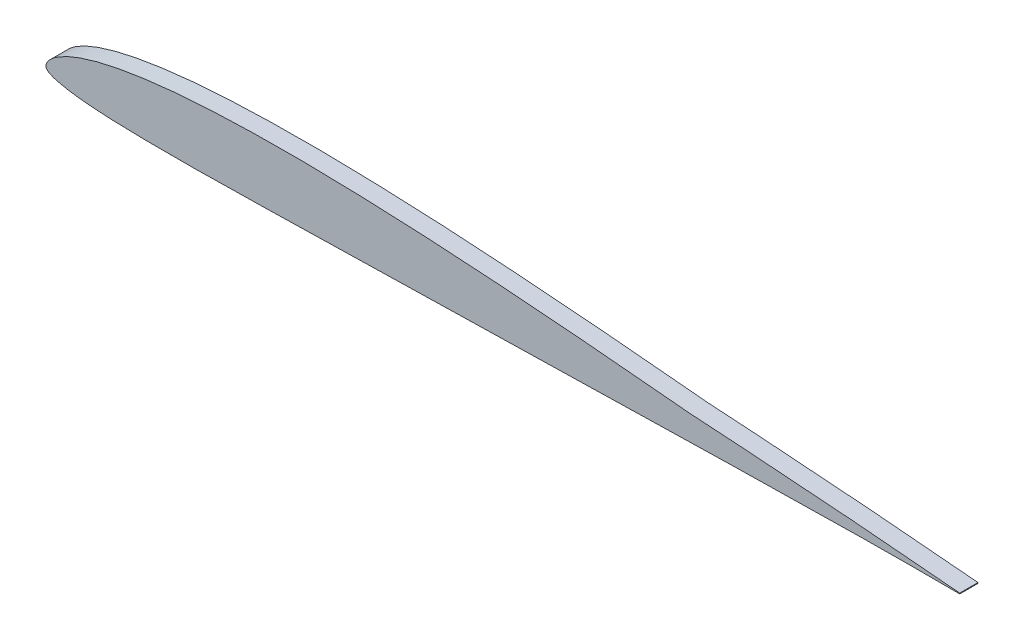
ISO-10303-21;
HEADER;
FILE_DESCRIPTION(('STEP AP214'),'2;1');
FILE_NAME('part.step','',(''),(''),'','','');
FILE_SCHEMA(('AUTOMOTIVE_DESIGN { 1 0 10303 214 1 1 1 1 }'));
ENDSEC;
DATA;
#1=APPLICATION_CONTEXT('core data for automotive mechanical design processes');
#2=APPLICATION_PROTOCOL_DEFINITION('international standard','automotive_design',2000,#1);
#3=PRODUCT_CONTEXT('',#1,'mechanical');
#4=PRODUCT('Part','Part','',(#3));
#5=PRODUCT_RELATED_PRODUCT_CATEGORY('part','',(#4));
#6=PRODUCT_DEFINITION_FORMATION('','',#4);
#7=PRODUCT_DEFINITION_CONTEXT('part definition',#1,'design');
#8=PRODUCT_DEFINITION('design','',#6,#7);
#9=PRODUCT_DEFINITION_SHAPE('','',#8);
#10=(LENGTH_UNIT() NAMED_UNIT(*) SI_UNIT(.MILLI.,.METRE.));
#11=(NAMED_UNIT(*) PLANE_ANGLE_UNIT() SI_UNIT($,.RADIAN.));
#12=(NAMED_UNIT(*) SI_UNIT($,.STERADIAN.) SOLID_ANGLE_UNIT());
#13=UNCERTAINTY_MEASURE_WITH_UNIT(LENGTH_MEASURE(1.E-05),#10,'distance_accuracy_value','');
#14=(GEOMETRIC_REPRESENTATION_CONTEXT(3) GLOBAL_UNCERTAINTY_ASSIGNED_CONTEXT((#13)) GLOBAL_UNIT_ASSIGNED_CONTEXT((#10,
#11,#12)) REPRESENTATION_CONTEXT('',''));
#15=CARTESIAN_POINT('',(0.,0.,0.));
#16=DIRECTION('',(0.,0.,1.));
#17=DIRECTION('',(1.,0.,0.));
#18=AXIS2_PLACEMENT_3D('',#15,#16,#17);
#19=CARTESIAN_POINT('',(127.,0.,1.27));
#20=DIRECTION('',(1.,0.,0.));
#21=DIRECTION('',(0.,0.,-1.));
#22=AXIS2_PLACEMENT_3D('',#19,#20,#21);
#23=PLANE('',#22);
#24=DIRECTION('',(0.,-1.,0.));
#25=VECTOR('',#24,1.);
#26=CARTESIAN_POINT('',(127.,0.,-1.27));
#27=LINE('',#26,#25);
#28=CARTESIAN_POINT('',(127.,0.053594,-1.27));
#29=VERTEX_POINT('',#28);
#30=CARTESIAN_POINT('',(127.,-0.053594,-1.27));
#31=VERTEX_POINT('',#30);
#32=EDGE_CURVE('E71',#29,#31,#27,.T.);
#33=ORIENTED_EDGE('',*,*,#32,.F.);
#34=DIRECTION('',(0.,0.,-1.));
#35=VECTOR('',#34,1.);
#36=CARTESIAN_POINT('',(127.,0.053594,1.27));
#37=LINE('',#36,#35);
#38=CARTESIAN_POINT('',(127.,0.053594,1.27));
#39=VERTEX_POINT('',#38);
#40=EDGE_CURVE('E11',#39,#29,#37,.T.);
#41=ORIENTED_EDGE('',*,*,#40,.F.);
#42=DIRECTION('',(0.,-1.,0.));
#43=VECTOR('',#42,1.);
#44=CARTESIAN_POINT('',(127.,0.,1.27));
#45=LINE('',#44,#43);
#46=CARTESIAN_POINT('',(127.,-0.053594,1.27));
#47=VERTEX_POINT('',#46);
#48=EDGE_CURVE('E72',#39,#47,#45,.T.);
#49=ORIENTED_EDGE('',*,*,#48,.T.);
#50=DIRECTION('',(0.,0.,-1.));
#51=VECTOR('',#50,1.);
#52=CARTESIAN_POINT('',(127.,-0.053594,1.27));
#53=LINE('',#52,#51);
#54=EDGE_CURVE('E51',#47,#31,#53,.T.);
#55=ORIENTED_EDGE('',*,*,#54,.T.);
#56=EDGE_LOOP('',(#33,#41,#49,#55));
#57=FACE_BOUND('',#56,.T.);
#58=ADVANCED_FACE('F43',(#57),#23,.T.);
#59=CARTESIAN_POINT('',(127.,0.053594,1.27));
#60=CARTESIAN_POINT('',(126.75319418678,0.0760877001744708,1.27));
#61=CARTESIAN_POINT('',(126.004566690037,0.144317059258043,1.27));
#62=CARTESIAN_POINT('',(124.687918153398,0.26566799016535,1.27));
#63=CARTESIAN_POINT('',(123.038030908359,0.409881648552028,1.27));
#64=CARTESIAN_POINT('',(121.307814074259,0.562155781187174,1.27));
#65=CARTESIAN_POINT('',(119.562633129905,0.71539766714406,1.27));
#66=CARTESIAN_POINT('',(117.812451704404,0.862564501981652,1.27));
#67=CARTESIAN_POINT('',(116.060214862568,1.00963672396759,1.27));
#68=CARTESIAN_POINT('',(114.306556411543,1.15328943024605,1.27));
#69=CARTESIAN_POINT('',(112.552387700521,1.29540650039443,1.27));
#70=CARTESIAN_POINT('',(110.798143323315,1.43442600335188,1.27));
#71=CARTESIAN_POINT('',(109.044365051303,1.5697547189875,1.27));
#72=CARTESIAN_POINT('',(107.291127286056,1.70453720468118,1.27));
#73=CARTESIAN_POINT('',(105.538591662357,1.83509140961561,1.27));
#74=CARTESIAN_POINT('',(103.78639240883,1.96419243775851,1.27));
#75=CARTESIAN_POINT('',(102.035125628558,2.09083844017822,1.27));
#76=CARTESIAN_POINT('',(100.284111126628,2.21396621736763,1.27));
#77=CARTESIAN_POINT('',(98.5338976732414,2.33644210727316,1.27));
#78=CARTESIAN_POINT('',(96.7839424193181,2.45553164938213,1.27));
#79=CARTESIAN_POINT('',(95.0346733309256,2.57230288775048,1.27));
#80=CARTESIAN_POINT('',(93.2855928271933,2.68714132598535,1.27));
#81=CARTESIAN_POINT('',(91.6673332137048,2.79159765227263,1.27));
#82=CARTESIAN_POINT('',(90.4092468709104,2.86960854047511,1.27));
#83=CARTESIAN_POINT('',(89.6232392785291,2.92147422543708,1.27));
#84=CARTESIAN_POINT('',(89.1782217924196,2.94414302640635,1.27));
#85=CARTESIAN_POINT('',(88.7362174579676,2.99151949227848,1.27));
#86=CARTESIAN_POINT('',(87.806500922895,3.07780939720151,1.27));
#87=CARTESIAN_POINT('',(86.3898248414768,3.21548481973008,1.27));
#88=CARTESIAN_POINT('',(84.9000745153053,3.35447567014728,1.27));
#89=CARTESIAN_POINT('',(83.5684462066837,3.47796115845127,1.27));
#90=CARTESIAN_POINT('',(82.3752833123043,3.58792063544386,1.27));
#91=CARTESIAN_POINT('',(80.8801635342438,3.72362614706067,1.27));
#92=CARTESIAN_POINT('',(79.1335610085478,3.88022628497266,1.27));
#93=CARTESIAN_POINT('',(77.3507061312034,4.03664925236581,1.27));
#94=CARTESIAN_POINT('',(75.5725163597116,4.18976836858316,1.27));
#95=CARTESIAN_POINT('',(73.8962587069289,4.33145377178328,1.27));
#96=CARTESIAN_POINT('',(72.2473727584334,4.46819039633799,1.27));
#97=CARTESIAN_POINT('',(70.8107414794783,4.58452840088692,1.27));
#98=CARTESIAN_POINT('',(69.6250397239119,4.67886406842905,1.27));
#99=CARTESIAN_POINT('',(68.3207797811173,4.78153377662967,1.27));
#100=CARTESIAN_POINT('',(66.8095914194517,4.89708183853389,1.27));
#101=CARTESIAN_POINT('',(65.0516605711408,5.02794392826452,1.27));
#102=CARTESIAN_POINT('',(63.2948900599047,5.15483673146866,1.27));
#103=CARTESIAN_POINT('',(60.9536399747879,5.31758786620498,1.27));
#104=CARTESIAN_POINT('',(58.6126490489154,5.47098533673743,1.27));
#105=CARTESIAN_POINT('',(56.2721308783602,5.61420587073317,1.27));
#106=CARTESIAN_POINT('',(54.5171554717241,5.71592524235253,1.27));
#107=CARTESIAN_POINT('',(52.1778177503657,5.84388822955764,1.27));
#108=CARTESIAN_POINT('',(49.8387184498259,5.95955970656226,1.27));
#109=CARTESIAN_POINT('',(47.49975183569,6.06166642703131,1.27));
#110=CARTESIAN_POINT('',(45.7461424988307,6.13153393158493,1.27));
#111=CARTESIAN_POINT('',(43.9929299603124,6.19316573020814,1.27));
#112=CARTESIAN_POINT('',(42.2402337876286,6.2469961682925,1.27));
#113=CARTESIAN_POINT('',(40.4882960744335,6.29239290652403,1.27));
#114=CARTESIAN_POINT('',(38.737205547812,6.32905629803844,1.27));
#115=CARTESIAN_POINT('',(36.9869912717093,6.3556705862806,1.27));
#116=CARTESIAN_POINT('',(35.2376678321487,6.37260324040424,1.27));
#117=CARTESIAN_POINT('',(33.4893907882479,6.37811191747323,1.27));
#118=CARTESIAN_POINT('',(31.742631161427,6.37192436236067,1.27));
#119=CARTESIAN_POINT('',(29.9975985158761,6.3531061745645,1.27));
#120=CARTESIAN_POINT('',(28.2547053622742,6.32103419240919,1.27));
#121=CARTESIAN_POINT('',(26.5142128192393,6.27395958198846,1.27));
#122=CARTESIAN_POINT('',(24.7767898217828,6.21093638304498,1.27));
#123=CARTESIAN_POINT('',(23.0433085854579,6.13069727113427,1.27));
#124=CARTESIAN_POINT('',(21.3143419035432,6.03117546444319,1.27));
#125=CARTESIAN_POINT('',(19.5913019235269,5.91138431241881,1.27));
#126=CARTESIAN_POINT('',(17.8753495630138,5.76821711898868,1.27));
#127=CARTESIAN_POINT('',(16.1680579760262,5.60017011071629,1.27));
#128=CARTESIAN_POINT('',(14.4722222518829,5.4033611781826,1.27));
#129=CARTESIAN_POINT('',(12.7903106392628,5.17550056025144,1.27));
#130=CARTESIAN_POINT('',(11.1272444513852,4.91189318520712,1.27));
#131=CARTESIAN_POINT('',(9.48772354162016,4.60720365358825,1.27));
#132=CARTESIAN_POINT('',(7.88100221551244,4.25542493792263,1.27));
#133=CARTESIAN_POINT('',(6.3216712421272,3.84919262199121,1.27));
#134=CARTESIAN_POINT('',(4.83837715763251,3.38537580015949,1.27));
#135=CARTESIAN_POINT('',(3.486169199981,2.86843121232047,1.27));
#136=CARTESIAN_POINT('',(2.34428983938669,2.32629002564457,1.27));
#137=CARTESIAN_POINT('',(1.47383404058277,1.80503420464493,1.27));
#138=CARTESIAN_POINT('',(0.873330800915139,1.34824020045603,1.27));
#139=CARTESIAN_POINT('',(0.483486894676334,0.969607531010342,1.27));
#140=CARTESIAN_POINT('',(0.235533738492551,0.655623709812797,1.27));
#141=CARTESIAN_POINT('',(0.0853520342493378,0.388606742708587,1.27));
#142=CARTESIAN_POINT('',(0.00927812601699419,0.159258482741594,1.27));
#143=CARTESIAN_POINT('',(-0.00821266072434666,-0.0427394405466579,1.27));
#144=CARTESIAN_POINT('',(0.0354334525350738,-0.233172338273624,1.27));
#145=CARTESIAN_POINT('',(0.160769968704994,-0.416078938521712,1.27));
#146=CARTESIAN_POINT('',(0.381844650874673,-0.578881525146638,1.27));
#147=CARTESIAN_POINT('',(0.702443674424843,-0.744483607979924,1.27));
#148=CARTESIAN_POINT('',(1.17377330793498,-0.923146695812726,1.27));
#149=CARTESIAN_POINT('',(1.87333696743001,-1.12192190327629,1.27));
#150=CARTESIAN_POINT('',(2.8633520711794,-1.32505144247377,1.27));
#151=CARTESIAN_POINT('',(4.13416468959408,-1.51440155121324,1.27));
#152=CARTESIAN_POINT('',(5.60877230207486,-1.67130723470471,1.27));
#153=CARTESIAN_POINT('',(7.1968927420956,-1.79206351657872,1.27));
#154=CARTESIAN_POINT('',(8.84203352220401,-1.88152604872054,1.27));
#155=CARTESIAN_POINT('',(10.5181010575966,-1.94501168978351,1.27));
#156=CARTESIAN_POINT('',(12.2137609505441,-1.98813481324923,1.27));
#157=CARTESIAN_POINT('',(13.923057968309,-2.01560335210805,1.27));
#158=CARTESIAN_POINT('',(15.6423059881636,-2.03055921304403,1.27));
#159=CARTESIAN_POINT('',(17.3693244917074,-2.03524324043674,1.27));
#160=CARTESIAN_POINT('',(19.1022592805304,-2.03037626821547,1.27));
#161=CARTESIAN_POINT('',(20.8401786618786,-2.01766100085378,1.27));
#162=CARTESIAN_POINT('',(22.581905240807,-1.99865422441457,1.27));
#163=CARTESIAN_POINT('',(24.327094148843,-1.97387003457827,1.27));
#164=CARTESIAN_POINT('',(26.0753733328439,-1.94491886359659,1.27));
#165=CARTESIAN_POINT('',(27.8272480845776,-1.91247873352249,1.27));
#166=CARTESIAN_POINT('',(29.5827269991568,-1.87760557598646,1.27));
#167=CARTESIAN_POINT('',(31.3420004639669,-1.84001927232577,1.27));
#168=CARTESIAN_POINT('',(33.1050651717955,-1.80190503114857,1.27));
#169=CARTESIAN_POINT('',(34.8722611776463,-1.76181877106513,1.27));
#170=CARTESIAN_POINT('',(36.6433146413193,-1.72100873165829,1.27));
#171=CARTESIAN_POINT('',(39.0108549371328,-1.66598694245539,1.27));
#172=CARTESIAN_POINT('',(41.381807412762,-1.60982731922993,1.27));
#173=CARTESIAN_POINT('',(43.7556056099178,-1.55381431875926,1.27));
#174=CARTESIAN_POINT('',(45.5385613105355,-1.5118494587281,1.27));
#175=CARTESIAN_POINT('',(47.3230333012694,-1.4695577504753,1.27));
#176=CARTESIAN_POINT('',(49.109250939379,-1.42764702237356,1.27));
#177=CARTESIAN_POINT('',(50.8974469594195,-1.38534156633297,1.27));
#178=CARTESIAN_POINT('',(52.686668924325,-1.34354342337719,1.27));
#179=CARTESIAN_POINT('',(54.475758497215,-1.3017274896245,1.27));
#180=CARTESIAN_POINT('',(56.2636196049197,-1.26012891208434,1.27));
#181=CARTESIAN_POINT('',(58.0503489114842,-1.21918597496924,1.27));
#182=CARTESIAN_POINT('',(59.8359986993292,-1.17761891256773,1.27));
#183=CARTESIAN_POINT('',(61.6204835927979,-1.13719504943686,1.27));
#184=CARTESIAN_POINT('',(63.4036441961708,-1.0966712943528,1.27));
#185=CARTESIAN_POINT('',(65.1856299674993,-1.05682485339863,1.27));
#186=CARTESIAN_POINT('',(66.9668411292636,-1.01667131145609,1.27));
#187=CARTESIAN_POINT('',(68.4747155725429,-0.983169691587939,1.27));
#188=CARTESIAN_POINT('',(70.2327829516203,-0.944255706780592,1.27));
#189=CARTESIAN_POINT('',(71.9672116383846,-0.905142512978061,1.27));
#190=CARTESIAN_POINT('',(73.9389771714879,-0.861463719592707,1.27));
#191=CARTESIAN_POINT('',(75.6551313622511,-0.823379674525717,1.27));
#192=CARTESIAN_POINT('',(77.3771162941416,-0.784663907131596,1.27));
#193=CARTESIAN_POINT('',(79.1169773862875,-0.746124442235304,1.27));
#194=CARTESIAN_POINT('',(80.6742928648956,-0.711626582348122,1.27));
#195=CARTESIAN_POINT('',(82.0377216584819,-0.681571553462625,1.27));
#196=CARTESIAN_POINT('',(83.189530455548,-0.656499214931409,1.27));
#197=CARTESIAN_POINT('',(84.5144318257775,-0.627441819123932,1.27));
#198=CARTESIAN_POINT('',(86.0361490285046,-0.59465529362139,1.27));
#199=CARTESIAN_POINT('',(87.4422888360555,-0.564185093919824,1.27));
#200=CARTESIAN_POINT('',(88.3954729035382,-0.544103577834738,1.27));
#201=CARTESIAN_POINT('',(88.8577451923321,-0.534031479617068,1.27));
#202=CARTESIAN_POINT('',(89.2505708617652,-0.526534285850712,1.27));
#203=CARTESIAN_POINT('',(90.0479873182019,-0.50896665570495,1.27));
#204=CARTESIAN_POINT('',(91.3450853055115,-0.481934603285221,1.27));
#205=CARTESIAN_POINT('',(93.0499315672945,-0.446327811565067,1.27));
#206=CARTESIAN_POINT('',(94.810657831413,-0.410085949918938,1.27));
#207=CARTESIAN_POINT('',(96.5704598214829,-0.374659880593233,1.27));
#208=CARTESIAN_POINT('',(98.3297848514143,-0.339179196717107,1.27));
#209=CARTESIAN_POINT('',(100.089333738135,-0.304693934884913,1.27));
#210=CARTESIAN_POINT('',(101.849164272931,-0.270047734707037,1.27));
#211=CARTESIAN_POINT('',(103.609427245489,-0.236629082761936,1.27));
#212=CARTESIAN_POINT('',(105.369927979664,-0.203795697934821,1.27));
#213=CARTESIAN_POINT('',(107.130919286059,-0.174231328217744,1.27));
#214=CARTESIAN_POINT('',(109.479457842885,-0.136894235956948,1.27));
#215=CARTESIAN_POINT('',(111.828794682434,-0.105060521529225,1.27));
#216=CARTESIAN_POINT('',(114.178357375734,-0.0783243595165123,1.27));
#217=CARTESIAN_POINT('',(115.941250847604,-0.0622964832726548,1.27));
#218=CARTESIAN_POINT('',(117.704221306388,-0.0489030142464174,1.27));
#219=CARTESIAN_POINT('',(119.467622016746,-0.0400310488749213,1.27));
#220=CARTESIAN_POINT('',(121.230174814352,-0.0355740861482252,1.27));
#221=CARTESIAN_POINT('',(122.981472145956,-0.0348565956638897,1.27));
#222=CARTESIAN_POINT('',(124.653848232825,-0.0417553928143516,1.27));
#223=CARTESIAN_POINT('',(125.989887142712,-0.0478343990504751,1.27));
#224=CARTESIAN_POINT('',(126.749429153548,-0.05216526055298,1.27));
#225=CARTESIAN_POINT('',(127.,-0.053594,1.27));
#226=B_SPLINE_CURVE_WITH_KNOTS('',3,(#59,#60,#61,#62,#63,#64,#65,#66,#67,#68,#69,#70,#71,#72,
#73,#74,#75,#76,#77,#78,#79,#80,#81,#82,#83,#84,#85,#86,#87,#88,#89,#90,#91,#92,#93,#94,#95,#96,
#97,#98,#99,#100,#101,#102,#103,#104,#105,#106,#107,#108,#109,#110,#111,#112,#113,#114,#115,
#116,#117,#118,#119,#120,#121,#122,#123,#124,#125,#126,#127,#128,#129,#130,#131,#132,#133,#134,
#135,#136,#137,#138,#139,#140,#141,#142,#143,#144,#145,#146,#147,#148,#149,#150,#151,#152,#153,
#154,#155,#156,#157,#158,#159,#160,#161,#162,#163,#164,#165,#166,#167,#168,#169,#170,#171,#172,
#173,#174,#175,#176,#177,#178,#179,#180,#181,#182,#183,#184,#185,#186,#187,#188,#189,#190,#191,
#192,#193,#194,#195,#196,#197,#198,#199,#200,#201,#202,#203,#204,#205,#206,#207,#208,#209,#210,
#211,#212,#213,#214,#215,#216,#217,#218,#219,#220,#221,#222,#223,#224,#225),.UNSPECIFIED.,.F.,
.F.,(4,1,1,1,1,1,1,1,1,1,1,1,1,1,1,1,1,1,1,1,1,1,1,1,1,1,1,1,1,1,1,1,1,1,1,1,1,1,1,1,1,1,1,1,1,
1,1,1,1,1,1,1,1,1,1,1,1,1,1,1,1,1,1,1,1,1,1,1,1,1,1,1,1,1,1,1,1,1,1,1,1,1,1,1,1,1,1,1,1,1,1,1,1,
1,1,1,1,1,1,1,1,1,1,1,1,1,1,1,1,1,1,1,1,1,1,1,1,1,1,1,1,1,1,1,1,1,1,1,1,1,1,1,1,1,1,1,1,1,1,1,1,
1,1,1,1,1,1,1,1,1,1,1,1,1,1,1,1,1,1,1,1,1,1,1,4),(0.,0.00290099659372873,0.00879949215818137,
0.0154775211449576,0.0222875942353728,0.0291311059359383,0.0359845727886083,0.0428468815231683,
0.0497142979882809,0.0565810302604014,0.0634478411876994,0.0703132293701872,0.0771711678945666,
0.0840311741497836,0.090884627100437,0.0977373955031283,0.10458440936198,0.111431995724545,
0.118274877415409,0.125116136448488,0.131953904848395,0.13879304095194,0.144098462846876,
0.146708547028149,0.148014315644422,0.149313146551483,0.151910855866899,0.15894466195637,
0.165973894108373,0.169425197998219,0.174599098038009,0.179999827222256,0.186998483896338,
0.195126221538068,0.200949456634637,0.207890370980172,0.214817865515354,0.22031697801188,
0.224762113608554,0.228741131521326,0.235631413074054,0.24250316876118,0.24937577864735,
0.256249105242001,0.269975124298455,0.276837253986749,0.283697593009064,0.290552692507618,
0.30426160656467,0.311111522811174,0.317957828523149,0.324804965375357,0.331646617506474,
0.338483878107494,0.345319338276512,0.352148660719282,0.358973534693761,0.365797142126222,
0.372613328234074,0.37942045451472,0.386224884987997,0.393018255101135,0.399801225843235,
0.406575620561957,0.41333111749985,0.420072961630209,0.426793048043559,0.433486562415399,
0.440153627327362,0.4467760361761,0.453352888479925,0.459861970007757,0.466293611508859,
0.472602109032427,0.478718386362554,0.484476600917274,0.489534096861973,0.493495638696748,
0.496331130758294,0.498346313282037,0.499841011263958,0.500999223663144,0.501914653491868,
0.502649229242367,0.503345398266634,0.50415780520335,0.505185160296857,0.506525739891464,
0.508375842410537,0.511073874727062,0.515031356802908,0.520196696865689,0.526108614995491,
0.532386125291835,0.538838474427164,0.545393384701584,0.552018992727712,0.558693317056157,
0.565404176163481,0.572144526051526,0.578909154577512,0.585689295212745,0.592488493333882,
0.59929836847987,0.606119896932364,0.612956027325966,0.619808706789196,0.62667296427988,
0.633554161890214,0.640451344600834,0.647364459483236,0.654290996191379,0.668172423609916,
0.675125781726664,0.682085580061521,0.689048857897814,0.696020050472818,0.703000171948541,
0.709986710377743,0.716969769396795,0.723948346696876,0.73092044933395,0.737890086365544,
0.744856198708493,0.751814361966286,0.758768528400392,0.765720713177421,0.772669892235555,
0.776423533560404,0.786305074021238,0.792977667356492,0.799509991668968,0.806398718942054,
0.813139712830137,0.819881191153094,0.824632580087798,0.829103409178679,0.833367054905999,
0.840145140127739,0.846920231426965,0.849830696568046,0.851305256070526,0.85233270963581,
0.854429810086703,0.860641790464031,0.867519382964738,0.874390493827504,0.881256599829939,
0.888123181315473,0.894988722653487,0.901857217200624,0.908727131150569,0.915597457074931,
0.922468598797302,0.929343574538009,0.943092095045522,0.949971603935152,0.956848493312481,
0.963728748261155,0.970608901330828,0.977490476697614,0.984360631540857,0.991108923943024,
0.997066858157041,1.),.UNSPECIFIED.);
#227=DIRECTION('',(0.,0.,-1.));
#228=VECTOR('',#227,1.);
#229=SURFACE_OF_LINEAR_EXTRUSION('',#226,#228);
#230=CARTESIAN_POINT('',(127.,0.053594,-1.27));
#231=CARTESIAN_POINT('',(126.75319418678,0.0760877001744708,-1.27));
#232=CARTESIAN_POINT('',(126.004566690037,0.144317059258043,-1.27));
#233=CARTESIAN_POINT('',(124.687918153398,0.26566799016535,-1.27));
#234=CARTESIAN_POINT('',(123.038030908359,0.409881648552028,-1.27));
#235=CARTESIAN_POINT('',(121.307814074259,0.562155781187174,-1.27));
#236=CARTESIAN_POINT('',(119.562633129905,0.71539766714406,-1.27));
#237=CARTESIAN_POINT('',(117.812451704404,0.862564501981652,-1.27));
#238=CARTESIAN_POINT('',(116.060214862568,1.00963672396759,-1.27));
#239=CARTESIAN_POINT('',(114.306556411543,1.15328943024605,-1.27));
#240=CARTESIAN_POINT('',(112.552387700521,1.29540650039443,-1.27));
#241=CARTESIAN_POINT('',(110.798143323315,1.43442600335188,-1.27));
#242=CARTESIAN_POINT('',(109.044365051303,1.5697547189875,-1.27));
#243=CARTESIAN_POINT('',(107.291127286056,1.70453720468118,-1.27));
#244=CARTESIAN_POINT('',(105.538591662357,1.83509140961561,-1.27));
#245=CARTESIAN_POINT('',(103.78639240883,1.96419243775851,-1.27));
#246=CARTESIAN_POINT('',(102.035125628558,2.09083844017822,-1.27));
#247=CARTESIAN_POINT('',(100.284111126628,2.21396621736763,-1.27));
#248=CARTESIAN_POINT('',(98.5338976732414,2.33644210727316,-1.27));
#249=CARTESIAN_POINT('',(96.7839424193181,2.45553164938213,-1.27));
#250=CARTESIAN_POINT('',(95.0346733309256,2.57230288775048,-1.27));
#251=CARTESIAN_POINT('',(93.2855928271933,2.68714132598535,-1.27));
#252=CARTESIAN_POINT('',(91.6673332137048,2.79159765227263,-1.27));
#253=CARTESIAN_POINT('',(90.4092468709104,2.86960854047511,-1.27));
#254=CARTESIAN_POINT('',(89.6232392785291,2.92147422543708,-1.27));
#255=CARTESIAN_POINT('',(89.1782217924196,2.94414302640635,-1.27));
#256=CARTESIAN_POINT('',(88.7362174579676,2.99151949227848,-1.27));
#257=CARTESIAN_POINT('',(87.806500922895,3.07780939720151,-1.27));
#258=CARTESIAN_POINT('',(86.3898248414768,3.21548481973008,-1.27));
#259=CARTESIAN_POINT('',(84.9000745153053,3.35447567014728,-1.27));
#260=CARTESIAN_POINT('',(83.5684462066837,3.47796115845127,-1.27));
#261=CARTESIAN_POINT('',(82.3752833123043,3.58792063544386,-1.27));
#262=CARTESIAN_POINT('',(80.8801635342438,3.72362614706067,-1.27));
#263=CARTESIAN_POINT('',(79.1335610085478,3.88022628497266,-1.27));
#264=CARTESIAN_POINT('',(77.3507061312034,4.03664925236581,-1.27));
#265=CARTESIAN_POINT('',(75.5725163597116,4.18976836858316,-1.27));
#266=CARTESIAN_POINT('',(73.8962587069289,4.33145377178328,-1.27));
#267=CARTESIAN_POINT('',(72.2473727584334,4.46819039633799,-1.27));
#268=CARTESIAN_POINT('',(70.8107414794783,4.58452840088692,-1.27));
#269=CARTESIAN_POINT('',(69.6250397239119,4.67886406842905,-1.27));
#270=CARTESIAN_POINT('',(68.3207797811173,4.78153377662967,-1.27));
#271=CARTESIAN_POINT('',(66.8095914194517,4.89708183853389,-1.27));
#272=CARTESIAN_POINT('',(65.0516605711408,5.02794392826452,-1.27));
#273=CARTESIAN_POINT('',(63.2948900599047,5.15483673146866,-1.27));
#274=CARTESIAN_POINT('',(60.9536399747879,5.31758786620498,-1.27));
#275=CARTESIAN_POINT('',(58.6126490489154,5.47098533673743,-1.27));
#276=CARTESIAN_POINT('',(56.2721308783602,5.61420587073317,-1.27));
#277=CARTESIAN_POINT('',(54.5171554717241,5.71592524235253,-1.27));
#278=CARTESIAN_POINT('',(52.1778177503657,5.84388822955764,-1.27));
#279=CARTESIAN_POINT('',(49.8387184498259,5.95955970656226,-1.27));
#280=CARTESIAN_POINT('',(47.49975183569,6.06166642703131,-1.27));
#281=CARTESIAN_POINT('',(45.7461424988307,6.13153393158493,-1.27));
#282=CARTESIAN_POINT('',(43.9929299603124,6.19316573020814,-1.27));
#283=CARTESIAN_POINT('',(42.2402337876286,6.2469961682925,-1.27));
#284=CARTESIAN_POINT('',(40.4882960744335,6.29239290652403,-1.27));
#285=CARTESIAN_POINT('',(38.737205547812,6.32905629803844,-1.27));
#286=CARTESIAN_POINT('',(36.9869912717093,6.3556705862806,-1.27));
#287=CARTESIAN_POINT('',(35.2376678321487,6.37260324040424,-1.27));
#288=CARTESIAN_POINT('',(33.4893907882479,6.37811191747323,-1.27));
#289=CARTESIAN_POINT('',(31.742631161427,6.37192436236067,-1.27));
#290=CARTESIAN_POINT('',(29.9975985158761,6.3531061745645,-1.27));
#291=CARTESIAN_POINT('',(28.2547053622742,6.32103419240919,-1.27));
#292=CARTESIAN_POINT('',(26.5142128192393,6.27395958198846,-1.27));
#293=CARTESIAN_POINT('',(24.7767898217828,6.21093638304498,-1.27));
#294=CARTESIAN_POINT('',(23.0433085854579,6.13069727113427,-1.27));
#295=CARTESIAN_POINT('',(21.3143419035432,6.03117546444319,-1.27));
#296=CARTESIAN_POINT('',(19.5913019235269,5.91138431241881,-1.27));
#297=CARTESIAN_POINT('',(17.8753495630138,5.76821711898868,-1.27));
#298=CARTESIAN_POINT('',(16.1680579760262,5.60017011071629,-1.27));
#299=CARTESIAN_POINT('',(14.4722222518829,5.4033611781826,-1.27));
#300=CARTESIAN_POINT('',(12.7903106392628,5.17550056025144,-1.27));
#301=CARTESIAN_POINT('',(11.1272444513852,4.91189318520712,-1.27));
#302=CARTESIAN_POINT('',(9.48772354162016,4.60720365358825,-1.27));
#303=CARTESIAN_POINT('',(7.88100221551244,4.25542493792263,-1.27));
#304=CARTESIAN_POINT('',(6.3216712421272,3.84919262199121,-1.27));
#305=CARTESIAN_POINT('',(4.83837715763251,3.38537580015949,-1.27));
#306=CARTESIAN_POINT('',(3.486169199981,2.86843121232047,-1.27));
#307=CARTESIAN_POINT('',(2.34428983938669,2.32629002564457,-1.27));
#308=CARTESIAN_POINT('',(1.47383404058277,1.80503420464493,-1.27));
#309=CARTESIAN_POINT('',(0.873330800915139,1.34824020045603,-1.27));
#310=CARTESIAN_POINT('',(0.483486894676334,0.969607531010342,-1.27));
#311=CARTESIAN_POINT('',(0.235533738492551,0.655623709812797,-1.27));
#312=CARTESIAN_POINT('',(0.0853520342493378,0.388606742708587,-1.27));
#313=CARTESIAN_POINT('',(0.00927812601699419,0.159258482741594,-1.27));
#314=CARTESIAN_POINT('',(-0.00821266072434666,-0.0427394405466579,-1.27));
#315=CARTESIAN_POINT('',(0.0354334525350738,-0.233172338273624,-1.27));
#316=CARTESIAN_POINT('',(0.160769968704994,-0.416078938521712,-1.27));
#317=CARTESIAN_POINT('',(0.381844650874673,-0.578881525146638,-1.27));
#318=CARTESIAN_POINT('',(0.702443674424843,-0.744483607979924,-1.27));
#319=CARTESIAN_POINT('',(1.17377330793498,-0.923146695812726,-1.27));
#320=CARTESIAN_POINT('',(1.87333696743001,-1.12192190327629,-1.27));
#321=CARTESIAN_POINT('',(2.8633520711794,-1.32505144247377,-1.27));
#322=CARTESIAN_POINT('',(4.13416468959408,-1.51440155121324,-1.27));
#323=CARTESIAN_POINT('',(5.60877230207486,-1.67130723470471,-1.27));
#324=CARTESIAN_POINT('',(7.1968927420956,-1.79206351657872,-1.27));
#325=CARTESIAN_POINT('',(8.84203352220401,-1.88152604872054,-1.27));
#326=CARTESIAN_POINT('',(10.5181010575966,-1.94501168978351,-1.27));
#327=CARTESIAN_POINT('',(12.2137609505441,-1.98813481324923,-1.27));
#328=CARTESIAN_POINT('',(13.923057968309,-2.01560335210805,-1.27));
#329=CARTESIAN_POINT('',(15.6423059881636,-2.03055921304403,-1.27));
#330=CARTESIAN_POINT('',(17.3693244917074,-2.03524324043674,-1.27));
#331=CARTESIAN_POINT('',(19.1022592805304,-2.03037626821547,-1.27));
#332=CARTESIAN_POINT('',(20.8401786618786,-2.01766100085378,-1.27));
#333=CARTESIAN_POINT('',(22.581905240807,-1.99865422441457,-1.27));
#334=CARTESIAN_POINT('',(24.327094148843,-1.97387003457827,-1.27));
#335=CARTESIAN_POINT('',(26.0753733328439,-1.94491886359659,-1.27));
#336=CARTESIAN_POINT('',(27.8272480845776,-1.91247873352249,-1.27));
#337=CARTESIAN_POINT('',(29.5827269991568,-1.87760557598646,-1.27));
#338=CARTESIAN_POINT('',(31.3420004639669,-1.84001927232577,-1.27));
#339=CARTESIAN_POINT('',(33.1050651717955,-1.80190503114857,-1.27));
#340=CARTESIAN_POINT('',(34.8722611776463,-1.76181877106513,-1.27));
#341=CARTESIAN_POINT('',(36.6433146413193,-1.72100873165829,-1.27));
#342=CARTESIAN_POINT('',(39.0108549371328,-1.66598694245539,-1.27));
#343=CARTESIAN_POINT('',(41.381807412762,-1.60982731922993,-1.27));
#344=CARTESIAN_POINT('',(43.7556056099178,-1.55381431875926,-1.27));
#345=CARTESIAN_POINT('',(45.5385613105355,-1.5118494587281,-1.27));
#346=CARTESIAN_POINT('',(47.3230333012694,-1.4695577504753,-1.27));
#347=CARTESIAN_POINT('',(49.109250939379,-1.42764702237356,-1.27));
#348=CARTESIAN_POINT('',(50.8974469594195,-1.38534156633297,-1.27));
#349=CARTESIAN_POINT('',(52.686668924325,-1.34354342337719,-1.27));
#350=CARTESIAN_POINT('',(54.475758497215,-1.3017274896245,-1.27));
#351=CARTESIAN_POINT('',(56.2636196049197,-1.26012891208434,-1.27));
#352=CARTESIAN_POINT('',(58.0503489114842,-1.21918597496924,-1.27));
#353=CARTESIAN_POINT('',(59.8359986993292,-1.17761891256773,-1.27));
#354=CARTESIAN_POINT('',(61.6204835927979,-1.13719504943686,-1.27));
#355=CARTESIAN_POINT('',(63.4036441961708,-1.0966712943528,-1.27));
#356=CARTESIAN_POINT('',(65.1856299674993,-1.05682485339863,-1.27));
#357=CARTESIAN_POINT('',(66.9668411292636,-1.01667131145609,-1.27));
#358=CARTESIAN_POINT('',(68.4747155725429,-0.983169691587939,-1.27));
#359=CARTESIAN_POINT('',(70.2327829516203,-0.944255706780592,-1.27));
#360=CARTESIAN_POINT('',(71.9672116383846,-0.905142512978061,-1.27));
#361=CARTESIAN_POINT('',(73.9389771714879,-0.861463719592707,-1.27));
#362=CARTESIAN_POINT('',(75.6551313622511,-0.823379674525717,-1.27));
#363=CARTESIAN_POINT('',(77.3771162941416,-0.784663907131596,-1.27));
#364=CARTESIAN_POINT('',(79.1169773862875,-0.746124442235304,-1.27));
#365=CARTESIAN_POINT('',(80.6742928648956,-0.711626582348122,-1.27));
#366=CARTESIAN_POINT('',(82.0377216584819,-0.681571553462625,-1.27));
#367=CARTESIAN_POINT('',(83.189530455548,-0.656499214931409,-1.27));
#368=CARTESIAN_POINT('',(84.5144318257775,-0.627441819123932,-1.27));
#369=CARTESIAN_POINT('',(86.0361490285046,-0.59465529362139,-1.27));
#370=CARTESIAN_POINT('',(87.4422888360555,-0.564185093919824,-1.27));
#371=CARTESIAN_POINT('',(88.3954729035382,-0.544103577834738,-1.27));
#372=CARTESIAN_POINT('',(88.8577451923321,-0.534031479617068,-1.27));
#373=CARTESIAN_POINT('',(89.2505708617652,-0.526534285850712,-1.27));
#374=CARTESIAN_POINT('',(90.0479873182019,-0.50896665570495,-1.27));
#375=CARTESIAN_POINT('',(91.3450853055115,-0.481934603285221,-1.27));
#376=CARTESIAN_POINT('',(93.0499315672945,-0.446327811565067,-1.27));
#377=CARTESIAN_POINT('',(94.810657831413,-0.410085949918938,-1.27));
#378=CARTESIAN_POINT('',(96.5704598214829,-0.374659880593233,-1.27));
#379=CARTESIAN_POINT('',(98.3297848514143,-0.339179196717107,-1.27));
#380=CARTESIAN_POINT('',(100.089333738135,-0.304693934884913,-1.27));
#381=CARTESIAN_POINT('',(101.849164272931,-0.270047734707037,-1.27));
#382=CARTESIAN_POINT('',(103.609427245489,-0.236629082761936,-1.27));
#383=CARTESIAN_POINT('',(105.369927979664,-0.203795697934821,-1.27));
#384=CARTESIAN_POINT('',(107.130919286059,-0.174231328217744,-1.27));
#385=CARTESIAN_POINT('',(109.479457842885,-0.136894235956948,-1.27));
#386=CARTESIAN_POINT('',(111.828794682434,-0.105060521529225,-1.27));
#387=CARTESIAN_POINT('',(114.178357375734,-0.0783243595165123,-1.27));
#388=CARTESIAN_POINT('',(115.941250847604,-0.0622964832726548,-1.27));
#389=CARTESIAN_POINT('',(117.704221306388,-0.0489030142464174,-1.27));
#390=CARTESIAN_POINT('',(119.467622016746,-0.0400310488749213,-1.27));
#391=CARTESIAN_POINT('',(121.230174814352,-0.0355740861482252,-1.27));
#392=CARTESIAN_POINT('',(122.981472145956,-0.0348565956638897,-1.27));
#393=CARTESIAN_POINT('',(124.653848232825,-0.0417553928143516,-1.27));
#394=CARTESIAN_POINT('',(125.989887142712,-0.0478343990504751,-1.27));
#395=CARTESIAN_POINT('',(126.749429153548,-0.05216526055298,-1.27));
#396=CARTESIAN_POINT('',(127.,-0.053594,-1.27));
#397=B_SPLINE_CURVE_WITH_KNOTS('',3,(#230,#231,#232,#233,#234,#235,#236,#237,#238,#239,#240,
#241,#242,#243,#244,#245,#246,#247,#248,#249,#250,#251,#252,#253,#254,#255,#256,#257,#258,#259,
#260,#261,#262,#263,#264,#265,#266,#267,#268,#269,#270,#271,#272,#273,#274,#275,#276,#277,#278,
#279,#280,#281,#282,#283,#284,#285,#286,#287,#288,#289,#290,#291,#292,#293,#294,#295,#296,#297,
#298,#299,#300,#301,#302,#303,#304,#305,#306,#307,#308,#309,#310,#311,#312,#313,#314,#315,#316,
#317,#318,#319,#320,#321,#322,#323,#324,#325,#326,#327,#328,#329,#330,#331,#332,#333,#334,#335,
#336,#337,#338,#339,#340,#341,#342,#343,#344,#345,#346,#347,#348,#349,#350,#351,#352,#353,#354,
#355,#356,#357,#358,#359,#360,#361,#362,#363,#364,#365,#366,#367,#368,#369,#370,#371,#372,#373,
#374,#375,#376,#377,#378,#379,#380,#381,#382,#383,#384,#385,#386,#387,#388,#389,#390,#391,#392,
#393,#394,#395,#396),.UNSPECIFIED.,.F.,.F.,(4,1,1,1,1,1,1,1,1,1,1,1,1,1,1,1,1,1,1,1,1,1,1,1,1,1,
1,1,1,1,1,1,1,1,1,1,1,1,1,1,1,1,1,1,1,1,1,1,1,1,1,1,1,1,1,1,1,1,1,1,1,1,1,1,1,1,1,1,1,1,1,1,1,1,
1,1,1,1,1,1,1,1,1,1,1,1,1,1,1,1,1,1,1,1,1,1,1,1,1,1,1,1,1,1,1,1,1,1,1,1,1,1,1,1,1,1,1,1,1,1,1,1,
1,1,1,1,1,1,1,1,1,1,1,1,1,1,1,1,1,1,1,1,1,1,1,1,1,1,1,1,1,1,1,1,1,1,1,1,1,1,1,1,1,1,4),(0.,
0.00290099659372873,0.00879949215818137,0.0154775211449576,0.0222875942353728,
0.0291311059359383,0.0359845727886083,0.0428468815231683,0.0497142979882809,0.0565810302604014,
0.0634478411876994,0.0703132293701872,0.0771711678945666,0.0840311741497836,0.090884627100437,
0.0977373955031283,0.10458440936198,0.111431995724545,0.118274877415409,0.125116136448488,
0.131953904848395,0.13879304095194,0.144098462846876,0.146708547028149,0.148014315644422,
0.149313146551483,0.151910855866899,0.15894466195637,0.165973894108373,0.169425197998219,
0.174599098038009,0.179999827222256,0.186998483896338,0.195126221538068,0.200949456634637,
0.207890370980172,0.214817865515354,0.22031697801188,0.224762113608554,0.228741131521326,
0.235631413074054,0.24250316876118,0.24937577864735,0.256249105242001,0.269975124298455,
0.276837253986749,0.283697593009064,0.290552692507618,0.30426160656467,0.311111522811174,
0.317957828523149,0.324804965375357,0.331646617506474,0.338483878107494,0.345319338276512,
0.352148660719282,0.358973534693761,0.365797142126222,0.372613328234074,0.37942045451472,
0.386224884987997,0.393018255101135,0.399801225843235,0.406575620561957,0.41333111749985,
0.420072961630209,0.426793048043559,0.433486562415399,0.440153627327362,0.4467760361761,
0.453352888479925,0.459861970007757,0.466293611508859,0.472602109032427,0.478718386362554,
0.484476600917274,0.489534096861973,0.493495638696748,0.496331130758294,0.498346313282037,
0.499841011263958,0.500999223663144,0.501914653491868,0.502649229242367,0.503345398266634,
0.50415780520335,0.505185160296857,0.506525739891464,0.508375842410537,0.511073874727062,
0.515031356802908,0.520196696865689,0.526108614995491,0.532386125291835,0.538838474427164,
0.545393384701584,0.552018992727712,0.558693317056157,0.565404176163481,0.572144526051526,
0.578909154577512,0.585689295212745,0.592488493333882,0.59929836847987,0.606119896932364,
0.612956027325966,0.619808706789196,0.62667296427988,0.633554161890214,0.640451344600834,
0.647364459483236,0.654290996191379,0.668172423609916,0.675125781726664,0.682085580061521,
0.689048857897814,0.696020050472818,0.703000171948541,0.709986710377743,0.716969769396795,
0.723948346696876,0.73092044933395,0.737890086365544,0.744856198708493,0.751814361966286,
0.758768528400392,0.765720713177421,0.772669892235555,0.776423533560404,0.786305074021238,
0.792977667356492,0.799509991668968,0.806398718942054,0.813139712830137,0.819881191153094,
0.824632580087798,0.829103409178679,0.833367054905999,0.840145140127739,0.846920231426965,
0.849830696568046,0.851305256070526,0.85233270963581,0.854429810086703,0.860641790464031,
0.867519382964738,0.874390493827504,0.881256599829939,0.888123181315473,0.894988722653487,
0.901857217200624,0.908727131150569,0.915597457074931,0.922468598797302,0.929343574538009,
0.943092095045522,0.949971603935152,0.956848493312481,0.963728748261155,0.970608901330828,
0.977490476697614,0.984360631540857,0.991108923943024,0.997066858157041,1.),.UNSPECIFIED.);
#398=EDGE_CURVE('E73',#29,#31,#397,.T.);
#399=ORIENTED_EDGE('',*,*,#398,.T.);
#400=ORIENTED_EDGE('',*,*,#54,.F.);
#401=EDGE_CURVE('E58',#39,#47,#226,.T.);
#402=ORIENTED_EDGE('',*,*,#401,.F.);
#403=ORIENTED_EDGE('',*,*,#40,.T.);
#404=EDGE_LOOP('',(#399,#400,#402,#403));
#405=FACE_BOUND('',#404,.T.);
#406=ADVANCED_FACE('F74',(#405),#229,.F.);
#407=CARTESIAN_POINT('',(0.,0.,1.27));
#408=DIRECTION('',(0.,0.,1.));
#409=DIRECTION('',(1.,0.,0.));
#410=AXIS2_PLACEMENT_3D('',#407,#408,#409);
#411=PLANE('',#410);
#412=ORIENTED_EDGE('',*,*,#48,.F.);
#413=ORIENTED_EDGE('',*,*,#401,.T.);
#414=EDGE_LOOP('',(#412,#413));
#415=FACE_BOUND('',#414,.T.);
#416=ADVANCED_FACE('F94',(#415),#411,.T.);
#417=CARTESIAN_POINT('',(0.,0.,-1.27));
#418=DIRECTION('',(0.,0.,1.));
#419=DIRECTION('',(1.,0.,0.));
#420=AXIS2_PLACEMENT_3D('',#417,#418,#419);
#421=PLANE('',#420);
#422=ORIENTED_EDGE('',*,*,#32,.T.);
#423=ORIENTED_EDGE('',*,*,#398,.F.);
#424=EDGE_LOOP('',(#422,#423));
#425=FACE_BOUND('',#424,.T.);
#426=ADVANCED_FACE('F77',(#425),#421,.F.);
#427=CLOSED_SHELL('',(#58,#406,#416,#426));
#428=MANIFOLD_SOLID_BREP('B2',#427);
#429=ADVANCED_BREP_SHAPE_REPRESENTATION('',(#18,#428),#14);
#430=SHAPE_DEFINITION_REPRESENTATION(#9,#429);
ENDSEC;
END-ISO-10303-21;
